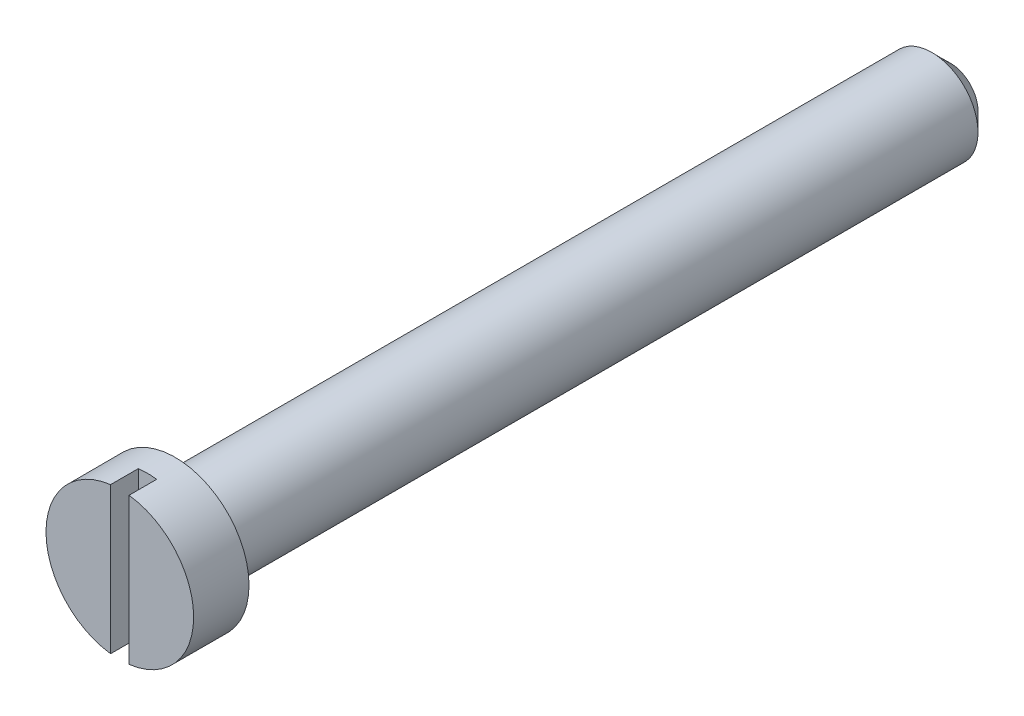
ISO-10303-21;
HEADER;
FILE_DESCRIPTION(('STEP AP214'),'2;1');
FILE_NAME('part.step','',(''),(''),'','','');
FILE_SCHEMA(('AUTOMOTIVE_DESIGN { 1 0 10303 214 1 1 1 1 }'));
ENDSEC;
DATA;
#1=APPLICATION_CONTEXT('core data for automotive mechanical design processes');
#2=APPLICATION_PROTOCOL_DEFINITION('international standard','automotive_design',2000,#1);
#3=PRODUCT_CONTEXT('',#1,'mechanical');
#4=PRODUCT('Part','Part','',(#3));
#5=PRODUCT_RELATED_PRODUCT_CATEGORY('part','',(#4));
#6=PRODUCT_DEFINITION_FORMATION('','',#4);
#7=PRODUCT_DEFINITION_CONTEXT('part definition',#1,'design');
#8=PRODUCT_DEFINITION('design','',#6,#7);
#9=PRODUCT_DEFINITION_SHAPE('','',#8);
#10=(LENGTH_UNIT() NAMED_UNIT(*) SI_UNIT(.MILLI.,.METRE.));
#11=(NAMED_UNIT(*) PLANE_ANGLE_UNIT() SI_UNIT($,.RADIAN.));
#12=(NAMED_UNIT(*) SI_UNIT($,.STERADIAN.) SOLID_ANGLE_UNIT());
#13=UNCERTAINTY_MEASURE_WITH_UNIT(LENGTH_MEASURE(1.E-05),#10,'distance_accuracy_value','');
#14=(GEOMETRIC_REPRESENTATION_CONTEXT(3) GLOBAL_UNCERTAINTY_ASSIGNED_CONTEXT((#13)) GLOBAL_UNIT_ASSIGNED_CONTEXT((#10,
#11,#12)) REPRESENTATION_CONTEXT('',''));
#15=CARTESIAN_POINT('',(0.,0.,0.));
#16=DIRECTION('',(0.,0.,1.));
#17=DIRECTION('',(1.,0.,0.));
#18=AXIS2_PLACEMENT_3D('',#15,#16,#17);
#19=CARTESIAN_POINT('',(0.,0.,45.));
#20=DIRECTION('',(0.,0.,1.));
#21=DIRECTION('',(1.,0.,0.));
#22=AXIS2_PLACEMENT_3D('',#19,#20,#21);
#23=PLANE('',#22);
#24=DIRECTION('',(0.,-1.,0.));
#25=VECTOR('',#24,1.);
#26=CARTESIAN_POINT('',(-0.5,0.,45.));
#27=LINE('',#26,#25);
#28=CARTESIAN_POINT('',(-0.5,3.96862696659689,45.));
#29=VERTEX_POINT('',#28);
#30=CARTESIAN_POINT('',(-0.5,-3.96862696659689,45.));
#31=VERTEX_POINT('',#30);
#32=EDGE_CURVE('E90',#29,#31,#27,.T.);
#33=ORIENTED_EDGE('',*,*,#32,.F.);
#34=CARTESIAN_POINT('',(0.,0.,45.));
#35=DIRECTION('',(0.,0.,1.));
#36=DIRECTION('',(1.,0.,0.));
#37=AXIS2_PLACEMENT_3D('',#34,#35,#36);
#38=CIRCLE('',#37,4.);
#39=EDGE_CURVE('E102',#29,#31,#38,.T.);
#40=ORIENTED_EDGE('',*,*,#39,.T.);
#41=EDGE_LOOP('',(#33,#40));
#42=FACE_BOUND('',#41,.T.);
#43=ADVANCED_FACE('F42',(#42),#23,.T.);
#44=CARTESIAN_POINT('',(0.,0.,45.));
#45=DIRECTION('',(0.,0.,-1.));
#46=DIRECTION('',(-1.,0.,0.));
#47=AXIS2_PLACEMENT_3D('',#44,#45,#46);
#48=CYLINDRICAL_SURFACE('',#47,2.5);
#49=CARTESIAN_POINT('',(0.,0.,1.00000000000004));
#50=DIRECTION('',(0.,0.,1.));
#51=DIRECTION('',(1.,0.,0.));
#52=AXIS2_PLACEMENT_3D('',#49,#50,#51);
#53=CIRCLE('',#52,2.5);
#54=CARTESIAN_POINT('',(2.5,0.,1.00000000000004));
#55=VERTEX_POINT('',#54);
#56=EDGE_CURVE('E112',#55,#55,#53,.T.);
#57=ORIENTED_EDGE('',*,*,#56,.T.);
#58=EDGE_LOOP('',(#57));
#59=FACE_BOUND('',#58,.T.);
#60=CARTESIAN_POINT('',(0.,0.,42.));
#61=DIRECTION('',(0.,0.,1.));
#62=DIRECTION('',(1.,0.,0.));
#63=AXIS2_PLACEMENT_3D('',#60,#61,#62);
#64=CIRCLE('',#63,2.5);
#65=CARTESIAN_POINT('',(2.5,0.,42.));
#66=VERTEX_POINT('',#65);
#67=EDGE_CURVE('E109',#66,#66,#64,.T.);
#68=ORIENTED_EDGE('',*,*,#67,.F.);
#69=EDGE_LOOP('',(#68));
#70=FACE_BOUND('',#69,.T.);
#71=ADVANCED_FACE('F121',(#59,#70),#48,.T.);
#72=CARTESIAN_POINT('',(0.,0.,0.));
#73=DIRECTION('',(0.,0.,1.));
#74=DIRECTION('',(1.,0.,0.));
#75=AXIS2_PLACEMENT_3D('',#72,#73,#74);
#76=PLANE('',#75);
#77=CARTESIAN_POINT('',(0.,0.,0.));
#78=DIRECTION('',(0.,0.,1.));
#79=DIRECTION('',(1.,0.,0.));
#80=AXIS2_PLACEMENT_3D('',#77,#78,#79);
#81=CIRCLE('',#80,1.49999999999995);
#82=CARTESIAN_POINT('',(1.49999999999995,0.,0.));
#83=VERTEX_POINT('',#82);
#84=EDGE_CURVE('E91',#83,#83,#81,.F.);
#85=ORIENTED_EDGE('',*,*,#84,.T.);
#86=EDGE_LOOP('',(#85));
#87=FACE_BOUND('',#86,.T.);
#88=ADVANCED_FACE('F126',(#87),#76,.F.);
#89=CARTESIAN_POINT('',(0.,0.,42.));
#90=DIRECTION('',(0.,0.,1.));
#91=DIRECTION('',(1.,0.,0.));
#92=AXIS2_PLACEMENT_3D('',#89,#90,#91);
#93=CYLINDRICAL_SURFACE('',#92,4.);
#94=DIRECTION('',(0.,0.,1.));
#95=VECTOR('',#94,1.);
#96=CARTESIAN_POINT('',(-0.5,-3.96862696659689,42.));
#97=LINE('',#96,#95);
#98=CARTESIAN_POINT('',(-0.5,-3.96862696659689,43.5));
#99=VERTEX_POINT('',#98);
#100=EDGE_CURVE('E65',#31,#99,#97,.F.);
#101=ORIENTED_EDGE('',*,*,#100,.F.);
#102=ORIENTED_EDGE('',*,*,#39,.F.);
#103=DIRECTION('',(0.,0.,1.));
#104=VECTOR('',#103,1.);
#105=CARTESIAN_POINT('',(-0.5,3.96862696659689,42.));
#106=LINE('',#105,#104);
#107=CARTESIAN_POINT('',(-0.5,3.96862696659689,43.5));
#108=VERTEX_POINT('',#107);
#109=EDGE_CURVE('E99',#108,#29,#106,.T.);
#110=ORIENTED_EDGE('',*,*,#109,.F.);
#111=CARTESIAN_POINT('',(0.,0.,43.5));
#112=DIRECTION('',(0.,0.,1.));
#113=DIRECTION('',(1.,0.,0.));
#114=AXIS2_PLACEMENT_3D('',#111,#112,#113);
#115=CIRCLE('',#114,4.);
#116=CARTESIAN_POINT('',(0.5,3.96862696659689,43.5));
#117=VERTEX_POINT('',#116);
#118=EDGE_CURVE('E46',#108,#117,#115,.F.);
#119=ORIENTED_EDGE('',*,*,#118,.T.);
#120=DIRECTION('',(0.,0.,1.));
#121=VECTOR('',#120,1.);
#122=CARTESIAN_POINT('',(0.5,3.96862696659689,42.));
#123=LINE('',#122,#121);
#124=CARTESIAN_POINT('',(0.5,3.96862696659689,45.));
#125=VERTEX_POINT('',#124);
#126=EDGE_CURVE('E85',#125,#117,#123,.F.);
#127=ORIENTED_EDGE('',*,*,#126,.F.);
#128=CARTESIAN_POINT('',(0.500000000000002,-3.96862696659689,45.));
#129=VERTEX_POINT('',#128);
#130=EDGE_CURVE('E97',#129,#125,#38,.T.);
#131=ORIENTED_EDGE('',*,*,#130,.F.);
#132=DIRECTION('',(0.,0.,1.));
#133=VECTOR('',#132,1.);
#134=CARTESIAN_POINT('',(0.500000000000002,-3.96862696659689,42.));
#135=LINE('',#134,#133);
#136=CARTESIAN_POINT('',(0.500000000000002,-3.96862696659689,43.5));
#137=VERTEX_POINT('',#136);
#138=EDGE_CURVE('E57',#137,#129,#135,.T.);
#139=ORIENTED_EDGE('',*,*,#138,.F.);
#140=EDGE_CURVE('E11',#137,#99,#115,.F.);
#141=ORIENTED_EDGE('',*,*,#140,.T.);
#142=EDGE_LOOP('',(#101,#102,#110,#119,#127,#131,#139,#141));
#143=FACE_BOUND('',#142,.T.);
#144=CARTESIAN_POINT('',(0.,0.,42.));
#145=DIRECTION('',(0.,0.,1.));
#146=DIRECTION('',(1.,0.,0.));
#147=AXIS2_PLACEMENT_3D('',#144,#145,#146);
#148=CIRCLE('',#147,4.);
#149=CARTESIAN_POINT('',(4.,0.,42.));
#150=VERTEX_POINT('',#149);
#151=EDGE_CURVE('E105',#150,#150,#148,.T.);
#152=ORIENTED_EDGE('',*,*,#151,.T.);
#153=EDGE_LOOP('',(#152));
#154=FACE_BOUND('',#153,.T.);
#155=ADVANCED_FACE('F95',(#143,#154),#93,.T.);
#156=CARTESIAN_POINT('',(0.,0.,42.));
#157=DIRECTION('',(0.,0.,1.));
#158=DIRECTION('',(1.,0.,0.));
#159=AXIS2_PLACEMENT_3D('',#156,#157,#158);
#160=PLANE('',#159);
#161=ORIENTED_EDGE('',*,*,#67,.T.);
#162=EDGE_LOOP('',(#161));
#163=FACE_BOUND('',#162,.T.);
#164=ORIENTED_EDGE('',*,*,#151,.F.);
#165=EDGE_LOOP('',(#164));
#166=FACE_BOUND('',#165,.T.);
#167=ADVANCED_FACE('F131',(#163,#166),#160,.F.);
#168=DIRECTION('',(0.,1.,0.));
#169=VECTOR('',#168,1.);
#170=CARTESIAN_POINT('',(0.500000000000001,0.,45.));
#171=LINE('',#170,#169);
#172=EDGE_CURVE('E82',#129,#125,#171,.T.);
#173=ORIENTED_EDGE('',*,*,#172,.F.);
#174=ORIENTED_EDGE('',*,*,#130,.T.);
#175=EDGE_LOOP('',(#173,#174));
#176=FACE_BOUND('',#175,.T.);
#177=ADVANCED_FACE('F101',(#176),#23,.T.);
#178=CARTESIAN_POINT('',(0.,0.,1.00000000000004));
#179=DIRECTION('',(0.,0.,1.));
#180=DIRECTION('',(1.,0.,0.));
#181=AXIS2_PLACEMENT_3D('',#178,#179,#180);
#182=CONICAL_SURFACE('',#181,2.5,0.785398163397451);
#183=ORIENTED_EDGE('',*,*,#84,.F.);
#184=EDGE_LOOP('',(#183));
#185=FACE_BOUND('',#184,.T.);
#186=ORIENTED_EDGE('',*,*,#56,.F.);
#187=EDGE_LOOP('',(#186));
#188=FACE_BOUND('',#187,.T.);
#189=ADVANCED_FACE('F44',(#185,#188),#182,.T.);
#190=CARTESIAN_POINT('',(-0.5,-4.,43.5));
#191=DIRECTION('',(-1.,0.,0.));
#192=DIRECTION('',(0.,0.,1.));
#193=AXIS2_PLACEMENT_3D('',#190,#191,#192);
#194=PLANE('',#193);
#195=ORIENTED_EDGE('',*,*,#100,.T.);
#196=DIRECTION('',(0.,-1.,0.));
#197=VECTOR('',#196,1.);
#198=CARTESIAN_POINT('',(-0.5,-4.,43.5));
#199=LINE('',#198,#197);
#200=EDGE_CURVE('E154',#108,#99,#199,.T.);
#201=ORIENTED_EDGE('',*,*,#200,.F.);
#202=ORIENTED_EDGE('',*,*,#109,.T.);
#203=ORIENTED_EDGE('',*,*,#32,.T.);
#204=EDGE_LOOP('',(#195,#201,#202,#203));
#205=FACE_BOUND('',#204,.T.);
#206=ADVANCED_FACE('F117',(#205),#194,.F.);
#207=CARTESIAN_POINT('',(0.500000000000002,-4.,43.5));
#208=DIRECTION('',(1.,0.,0.));
#209=DIRECTION('',(0.,1.,0.));
#210=AXIS2_PLACEMENT_3D('',#207,#208,#209);
#211=PLANE('',#210);
#212=ORIENTED_EDGE('',*,*,#126,.T.);
#213=DIRECTION('',(0.,1.,0.));
#214=VECTOR('',#213,1.);
#215=CARTESIAN_POINT('',(0.500000000000002,-4.,43.5));
#216=LINE('',#215,#214);
#217=EDGE_CURVE('E153',#137,#117,#216,.T.);
#218=ORIENTED_EDGE('',*,*,#217,.F.);
#219=ORIENTED_EDGE('',*,*,#138,.T.);
#220=ORIENTED_EDGE('',*,*,#172,.T.);
#221=EDGE_LOOP('',(#212,#218,#219,#220));
#222=FACE_BOUND('',#221,.T.);
#223=ADVANCED_FACE('F84',(#222),#211,.F.);
#224=CARTESIAN_POINT('',(0.,0.,43.5));
#225=DIRECTION('',(0.,0.,1.));
#226=DIRECTION('',(1.,0.,0.));
#227=AXIS2_PLACEMENT_3D('',#224,#225,#226);
#228=PLANE('',#227);
#229=ORIENTED_EDGE('',*,*,#217,.T.);
#230=ORIENTED_EDGE('',*,*,#118,.F.);
#231=ORIENTED_EDGE('',*,*,#200,.T.);
#232=ORIENTED_EDGE('',*,*,#140,.F.);
#233=EDGE_LOOP('',(#229,#230,#231,#232));
#234=FACE_BOUND('',#233,.T.);
#235=ADVANCED_FACE('F146',(#234),#228,.T.);
#236=CLOSED_SHELL('',(#43,#71,#88,#155,#167,#177,#189,#206,#223,#235));
#237=MANIFOLD_SOLID_BREP('B2',#236);
#238=ADVANCED_BREP_SHAPE_REPRESENTATION('',(#18,#237),#14);
#239=SHAPE_DEFINITION_REPRESENTATION(#9,#238);
ENDSEC;
END-ISO-10303-21;
